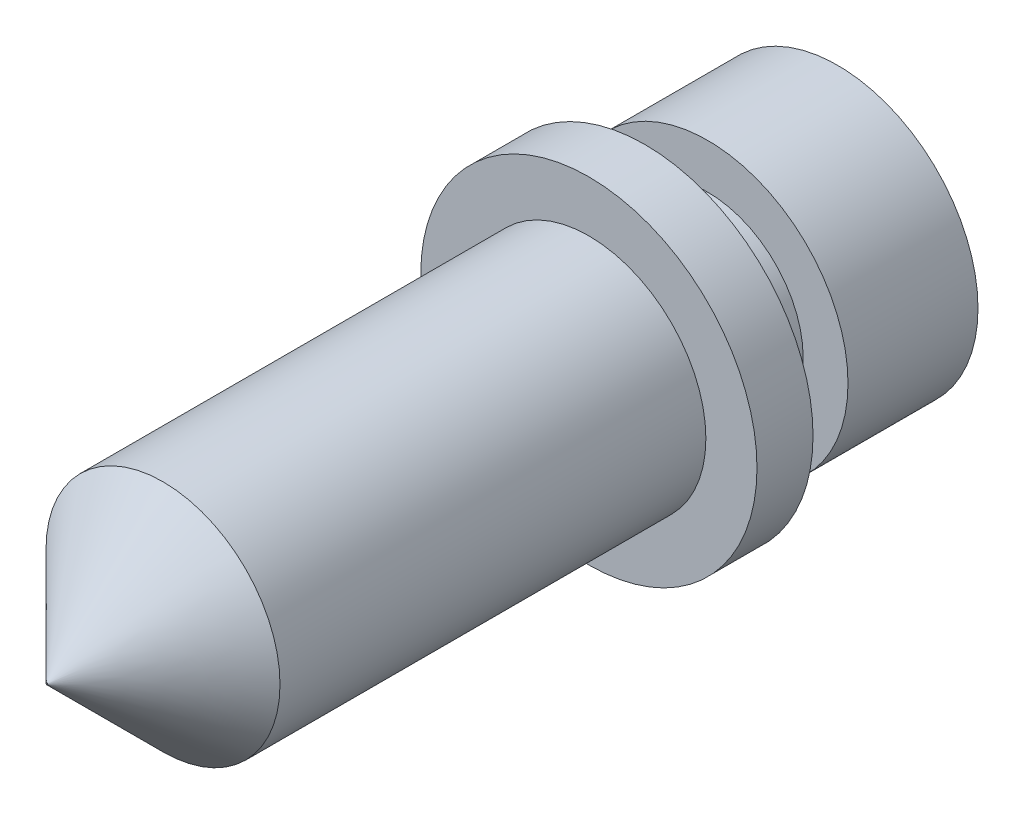
ISO-10303-21;
HEADER;
FILE_DESCRIPTION(('STEP AP214'),'2;1');
FILE_NAME('part.step','',(''),(''),'','','');
FILE_SCHEMA(('AUTOMOTIVE_DESIGN { 1 0 10303 214 1 1 1 1 }'));
ENDSEC;
DATA;
#1=APPLICATION_CONTEXT('core data for automotive mechanical design processes');
#2=APPLICATION_PROTOCOL_DEFINITION('international standard','automotive_design',2000,#1);
#3=PRODUCT_CONTEXT('',#1,'mechanical');
#4=PRODUCT('Part','Part','',(#3));
#5=PRODUCT_RELATED_PRODUCT_CATEGORY('part','',(#4));
#6=PRODUCT_DEFINITION_FORMATION('','',#4);
#7=PRODUCT_DEFINITION_CONTEXT('part definition',#1,'design');
#8=PRODUCT_DEFINITION('design','',#6,#7);
#9=PRODUCT_DEFINITION_SHAPE('','',#8);
#10=(LENGTH_UNIT() NAMED_UNIT(*) SI_UNIT(.MILLI.,.METRE.));
#11=(NAMED_UNIT(*) PLANE_ANGLE_UNIT() SI_UNIT($,.RADIAN.));
#12=(NAMED_UNIT(*) SI_UNIT($,.STERADIAN.) SOLID_ANGLE_UNIT());
#13=UNCERTAINTY_MEASURE_WITH_UNIT(LENGTH_MEASURE(1.E-05),#10,'distance_accuracy_value','');
#14=(GEOMETRIC_REPRESENTATION_CONTEXT(3) GLOBAL_UNCERTAINTY_ASSIGNED_CONTEXT((#13)) GLOBAL_UNIT_ASSIGNED_CONTEXT((#10,
#11,#12)) REPRESENTATION_CONTEXT('',''));
#15=CARTESIAN_POINT('',(0.,0.,0.));
#16=DIRECTION('',(0.,0.,1.));
#17=DIRECTION('',(1.,0.,0.));
#18=AXIS2_PLACEMENT_3D('',#15,#16,#17);
#19=CARTESIAN_POINT('',(0.,0.,12.85875));
#20=DIRECTION('',(0.,0.,-1.));
#21=DIRECTION('',(-1.,0.,0.));
#22=AXIS2_PLACEMENT_3D('',#19,#20,#21);
#23=CONICAL_SURFACE('',#22,3.3147,0.785398163397453);
#24=CARTESIAN_POINT('',(0.,0.,12.85875));
#25=DIRECTION('',(0.,0.,1.));
#26=DIRECTION('',(1.,0.,0.));
#27=AXIS2_PLACEMENT_3D('',#24,#25,#26);
#28=CIRCLE('',#27,3.3147);
#29=CARTESIAN_POINT('',(3.3147,0.,12.85875));
#30=VERTEX_POINT('',#29);
#31=EDGE_CURVE('E59',#30,#30,#28,.T.);
#32=ORIENTED_EDGE('',*,*,#31,.T.);
#33=EDGE_LOOP('',(#32));
#34=FACE_BOUND('',#33,.T.);
#35=CARTESIAN_POINT('',(0.,0.,16.14805));
#36=DIRECTION('',(0.,0.,1.));
#37=DIRECTION('',(1.,0.,0.));
#38=AXIS2_PLACEMENT_3D('',#35,#36,#37);
#39=CIRCLE('',#38,0.0253999999999992);
#40=CARTESIAN_POINT('',(0.0253999999999992,0.,16.14805));
#41=VERTEX_POINT('',#40);
#42=EDGE_CURVE('E49',#41,#41,#39,.F.);
#43=ORIENTED_EDGE('',*,*,#42,.T.);
#44=EDGE_LOOP('',(#43));
#45=FACE_BOUND('',#44,.T.);
#46=ADVANCED_FACE('F31',(#34,#45),#23,.T.);
#47=CARTESIAN_POINT('',(0.,0.,0.79375));
#48=DIRECTION('',(0.,0.,1.));
#49=DIRECTION('',(1.,0.,0.));
#50=AXIS2_PLACEMENT_3D('',#47,#48,#49);
#51=PLANE('',#50);
#52=CARTESIAN_POINT('',(0.,0.,0.79375));
#53=DIRECTION('',(0.,0.,1.));
#54=DIRECTION('',(1.,0.,0.));
#55=AXIS2_PLACEMENT_3D('',#52,#53,#54);
#56=CIRCLE('',#55,4.7625);
#57=CARTESIAN_POINT('',(4.7625,0.,0.79375));
#58=VERTEX_POINT('',#57);
#59=EDGE_CURVE('E42',#58,#58,#56,.T.);
#60=ORIENTED_EDGE('',*,*,#59,.T.);
#61=EDGE_LOOP('',(#60));
#62=FACE_BOUND('',#61,.T.);
#63=CARTESIAN_POINT('',(0.,0.,0.79375));
#64=DIRECTION('',(0.,0.,1.));
#65=DIRECTION('',(1.,0.,0.));
#66=AXIS2_PLACEMENT_3D('',#63,#64,#65);
#67=CIRCLE('',#66,3.3147);
#68=CARTESIAN_POINT('',(3.3147,0.,0.79375));
#69=VERTEX_POINT('',#68);
#70=EDGE_CURVE('E60',#69,#69,#67,.T.);
#71=ORIENTED_EDGE('',*,*,#70,.F.);
#72=EDGE_LOOP('',(#71));
#73=FACE_BOUND('',#72,.T.);
#74=ADVANCED_FACE('F97',(#62,#73),#51,.T.);
#75=CARTESIAN_POINT('',(0.,0.,-0.79375));
#76=DIRECTION('',(0.,0.,1.));
#77=DIRECTION('',(1.,0.,0.));
#78=AXIS2_PLACEMENT_3D('',#75,#76,#77);
#79=PLANE('',#78);
#80=CARTESIAN_POINT('',(0.,0.,-0.79375));
#81=DIRECTION('',(0.,0.,1.));
#82=DIRECTION('',(1.,0.,0.));
#83=AXIS2_PLACEMENT_3D('',#80,#81,#82);
#84=CIRCLE('',#83,4.7625);
#85=CARTESIAN_POINT('',(4.7625,0.,-0.79375));
#86=VERTEX_POINT('',#85);
#87=EDGE_CURVE('E46',#86,#86,#84,.T.);
#88=ORIENTED_EDGE('',*,*,#87,.F.);
#89=EDGE_LOOP('',(#88));
#90=FACE_BOUND('',#89,.T.);
#91=CARTESIAN_POINT('',(0.,0.,-0.79375));
#92=DIRECTION('',(0.,0.,1.));
#93=DIRECTION('',(1.,0.,0.));
#94=AXIS2_PLACEMENT_3D('',#91,#92,#93);
#95=CIRCLE('',#94,2.7051);
#96=CARTESIAN_POINT('',(2.7051,0.,-0.79375));
#97=VERTEX_POINT('',#96);
#98=EDGE_CURVE('E52',#97,#97,#95,.T.);
#99=ORIENTED_EDGE('',*,*,#98,.T.);
#100=EDGE_LOOP('',(#99));
#101=FACE_BOUND('',#100,.T.);
#102=ADVANCED_FACE('F103',(#90,#101),#79,.F.);
#103=CARTESIAN_POINT('',(0.,0.,0.79375));
#104=DIRECTION('',(0.,0.,-1.));
#105=DIRECTION('',(-1.,0.,0.));
#106=AXIS2_PLACEMENT_3D('',#103,#104,#105);
#107=CYLINDRICAL_SURFACE('',#106,4.7625);
#108=ORIENTED_EDGE('',*,*,#59,.F.);
#109=EDGE_LOOP('',(#108));
#110=FACE_BOUND('',#109,.T.);
#111=ORIENTED_EDGE('',*,*,#87,.T.);
#112=EDGE_LOOP('',(#111));
#113=FACE_BOUND('',#112,.T.);
#114=ADVANCED_FACE('F115',(#110,#113),#107,.T.);
#115=CARTESIAN_POINT('',(0.,0.,12.85875));
#116=DIRECTION('',(0.,0.,-1.));
#117=DIRECTION('',(-1.,0.,0.));
#118=AXIS2_PLACEMENT_3D('',#115,#116,#117);
#119=CYLINDRICAL_SURFACE('',#118,3.3147);
#120=ORIENTED_EDGE('',*,*,#31,.F.);
#121=EDGE_LOOP('',(#120));
#122=FACE_BOUND('',#121,.T.);
#123=ORIENTED_EDGE('',*,*,#70,.T.);
#124=EDGE_LOOP('',(#123));
#125=FACE_BOUND('',#124,.T.);
#126=ADVANCED_FACE('F111',(#122,#125),#119,.T.);
#127=CARTESIAN_POINT('',(-3.9751,0.,-2.57175));
#128=DIRECTION('',(0.,0.,1.));
#129=DIRECTION('',(1.,0.,0.));
#130=AXIS2_PLACEMENT_3D('',#127,#128,#129);
#131=PLANE('',#130);
#132=CARTESIAN_POINT('',(0.,0.,-2.57175));
#133=DIRECTION('',(0.,0.,1.));
#134=DIRECTION('',(1.,0.,0.));
#135=AXIS2_PLACEMENT_3D('',#132,#133,#134);
#136=CIRCLE('',#135,3.9751);
#137=CARTESIAN_POINT('',(3.9751,0.,-2.57175));
#138=VERTEX_POINT('',#137);
#139=EDGE_CURVE('E68',#138,#138,#136,.T.);
#140=ORIENTED_EDGE('',*,*,#139,.T.);
#141=EDGE_LOOP('',(#140));
#142=FACE_BOUND('',#141,.T.);
#143=CARTESIAN_POINT('',(0.,0.,-2.57175));
#144=DIRECTION('',(0.,0.,1.));
#145=DIRECTION('',(1.,0.,0.));
#146=AXIS2_PLACEMENT_3D('',#143,#144,#145);
#147=CIRCLE('',#146,2.7051);
#148=CARTESIAN_POINT('',(2.7051,0.,-2.57175));
#149=VERTEX_POINT('',#148);
#150=EDGE_CURVE('E71',#149,#149,#147,.T.);
#151=ORIENTED_EDGE('',*,*,#150,.F.);
#152=EDGE_LOOP('',(#151));
#153=FACE_BOUND('',#152,.T.);
#154=ADVANCED_FACE('F114',(#142,#153),#131,.T.);
#155=CARTESIAN_POINT('',(0.,0.,0.));
#156=DIRECTION('',(0.,0.,1.));
#157=DIRECTION('',(1.,0.,0.));
#158=AXIS2_PLACEMENT_3D('',#155,#156,#157);
#159=CYLINDRICAL_SURFACE('',#158,2.7051);
#160=ORIENTED_EDGE('',*,*,#150,.T.);
#161=EDGE_LOOP('',(#160));
#162=FACE_BOUND('',#161,.T.);
#163=ORIENTED_EDGE('',*,*,#98,.F.);
#164=EDGE_LOOP('',(#163));
#165=FACE_BOUND('',#164,.T.);
#166=ADVANCED_FACE('F135',(#162,#165),#159,.T.);
#167=CARTESIAN_POINT('',(0.,0.,12.79525));
#168=DIRECTION('',(0.,0.,-1.));
#169=DIRECTION('',(-1.,0.,0.));
#170=AXIS2_PLACEMENT_3D('',#167,#168,#169);
#171=PLANE('',#170);
#172=CARTESIAN_POINT('',(0.,0.,12.79525));
#173=DIRECTION('',(0.,0.,-1.));
#174=DIRECTION('',(-1.,0.,0.));
#175=AXIS2_PLACEMENT_3D('',#172,#173,#174);
#176=CIRCLE('',#175,0.0200000000000001);
#177=CARTESIAN_POINT('',(-0.0200000000000001,0.,12.79525));
#178=VERTEX_POINT('',#177);
#179=EDGE_CURVE('E53',#178,#178,#176,.T.);
#180=ORIENTED_EDGE('',*,*,#179,.F.);
#181=EDGE_LOOP('',(#180));
#182=FACE_BOUND('',#181,.T.);
#183=CARTESIAN_POINT('',(0.,0.,12.79525));
#184=DIRECTION('',(0.,0.,-1.));
#185=DIRECTION('',(-1.,0.,0.));
#186=AXIS2_PLACEMENT_3D('',#183,#184,#185);
#187=CIRCLE('',#186,1.5875);
#188=CARTESIAN_POINT('',(-1.5875,0.,12.79525));
#189=VERTEX_POINT('',#188);
#190=EDGE_CURVE('E63',#189,#189,#187,.T.);
#191=ORIENTED_EDGE('',*,*,#190,.T.);
#192=EDGE_LOOP('',(#191));
#193=FACE_BOUND('',#192,.T.);
#194=ADVANCED_FACE('F137',(#182,#193),#171,.T.);
#195=CARTESIAN_POINT('',(0.,0.,12.79525));
#196=DIRECTION('',(0.,0.,-1.));
#197=DIRECTION('',(-1.,0.,0.));
#198=AXIS2_PLACEMENT_3D('',#195,#196,#197);
#199=CYLINDRICAL_SURFACE('',#198,1.5875);
#200=CARTESIAN_POINT('',(0.,0.,-4.98475));
#201=DIRECTION('',(0.,0.,-1.));
#202=DIRECTION('',(-1.,0.,0.));
#203=AXIS2_PLACEMENT_3D('',#200,#201,#202);
#204=CIRCLE('',#203,1.5875);
#205=CARTESIAN_POINT('',(-1.5875,0.,-4.98475));
#206=VERTEX_POINT('',#205);
#207=EDGE_CURVE('E38',#206,#206,#204,.T.);
#208=ORIENTED_EDGE('',*,*,#207,.T.);
#209=EDGE_LOOP('',(#208));
#210=FACE_BOUND('',#209,.T.);
#211=ORIENTED_EDGE('',*,*,#190,.F.);
#212=EDGE_LOOP('',(#211));
#213=FACE_BOUND('',#212,.T.);
#214=ADVANCED_FACE('F109',(#210,#213),#199,.F.);
#215=CARTESIAN_POINT('',(0.,0.,-6.25475));
#216=DIRECTION('',(0.,0.,-1.));
#217=DIRECTION('',(-1.,0.,0.));
#218=AXIS2_PLACEMENT_3D('',#215,#216,#217);
#219=PLANE('',#218);
#220=CARTESIAN_POINT('',(0.,0.,-6.25475));
#221=DIRECTION('',(0.,0.,-1.));
#222=DIRECTION('',(-1.,0.,0.));
#223=AXIS2_PLACEMENT_3D('',#220,#221,#222);
#224=CIRCLE('',#223,2.85750000000001);
#225=CARTESIAN_POINT('',(-2.85750000000001,0.,-6.25475));
#226=VERTEX_POINT('',#225);
#227=EDGE_CURVE('E10',#226,#226,#224,.F.);
#228=ORIENTED_EDGE('',*,*,#227,.T.);
#229=EDGE_LOOP('',(#228));
#230=FACE_BOUND('',#229,.T.);
#231=CARTESIAN_POINT('',(0.,0.,-6.25475));
#232=DIRECTION('',(0.,0.,-1.));
#233=DIRECTION('',(-1.,0.,0.));
#234=AXIS2_PLACEMENT_3D('',#231,#232,#233);
#235=CIRCLE('',#234,3.9751);
#236=CARTESIAN_POINT('',(-3.9751,0.,-6.25475));
#237=VERTEX_POINT('',#236);
#238=EDGE_CURVE('E55',#237,#237,#235,.T.);
#239=ORIENTED_EDGE('',*,*,#238,.T.);
#240=EDGE_LOOP('',(#239));
#241=FACE_BOUND('',#240,.T.);
#242=ADVANCED_FACE('F117',(#230,#241),#219,.T.);
#243=CARTESIAN_POINT('',(0.,0.,-6.25475));
#244=DIRECTION('',(0.,0.,1.));
#245=DIRECTION('',(1.,0.,0.));
#246=AXIS2_PLACEMENT_3D('',#243,#244,#245);
#247=CYLINDRICAL_SURFACE('',#246,3.9751);
#248=ORIENTED_EDGE('',*,*,#238,.F.);
#249=EDGE_LOOP('',(#248));
#250=FACE_BOUND('',#249,.T.);
#251=ORIENTED_EDGE('',*,*,#139,.F.);
#252=EDGE_LOOP('',(#251));
#253=FACE_BOUND('',#252,.T.);
#254=ADVANCED_FACE('F94',(#250,#253),#247,.T.);
#255=CARTESIAN_POINT('',(0.,0.,16.14805));
#256=DIRECTION('',(0.,0.,1.));
#257=DIRECTION('',(1.,0.,0.));
#258=AXIS2_PLACEMENT_3D('',#255,#256,#257);
#259=PLANE('',#258);
#260=CARTESIAN_POINT('',(0.,0.,16.14805));
#261=DIRECTION('',(0.,0.,-1.));
#262=DIRECTION('',(-1.,0.,0.));
#263=AXIS2_PLACEMENT_3D('',#260,#261,#262);
#264=CIRCLE('',#263,0.0200000000000001);
#265=CARTESIAN_POINT('',(-0.0200000000000001,0.,16.14805));
#266=VERTEX_POINT('',#265);
#267=EDGE_CURVE('E78',#266,#266,#264,.T.);
#268=ORIENTED_EDGE('',*,*,#267,.T.);
#269=EDGE_LOOP('',(#268));
#270=FACE_BOUND('',#269,.T.);
#271=ORIENTED_EDGE('',*,*,#42,.F.);
#272=EDGE_LOOP('',(#271));
#273=FACE_BOUND('',#272,.T.);
#274=ADVANCED_FACE('F82',(#270,#273),#259,.T.);
#275=CARTESIAN_POINT('',(0.,0.,16.14805));
#276=DIRECTION('',(0.,0.,-1.));
#277=DIRECTION('',(-1.,0.,0.));
#278=AXIS2_PLACEMENT_3D('',#275,#276,#277);
#279=CYLINDRICAL_SURFACE('',#278,0.0200000000000001);
#280=ORIENTED_EDGE('',*,*,#179,.T.);
#281=EDGE_LOOP('',(#280));
#282=FACE_BOUND('',#281,.T.);
#283=ORIENTED_EDGE('',*,*,#267,.F.);
#284=EDGE_LOOP('',(#283));
#285=FACE_BOUND('',#284,.T.);
#286=ADVANCED_FACE('F85',(#282,#285),#279,.F.);
#287=CARTESIAN_POINT('',(0.,0.,-4.98475));
#288=DIRECTION('',(0.,0.,-1.));
#289=DIRECTION('',(-1.,0.,0.));
#290=AXIS2_PLACEMENT_3D('',#287,#288,#289);
#291=CONICAL_SURFACE('',#290,1.5875,0.785398163397451);
#292=ORIENTED_EDGE('',*,*,#227,.F.);
#293=EDGE_LOOP('',(#292));
#294=FACE_BOUND('',#293,.T.);
#295=ORIENTED_EDGE('',*,*,#207,.F.);
#296=EDGE_LOOP('',(#295));
#297=FACE_BOUND('',#296,.T.);
#298=ADVANCED_FACE('F33',(#294,#297),#291,.F.);
#299=CLOSED_SHELL('',(#46,#74,#102,#114,#126,#154,#166,#194,#214,#242,#254,#274,#286,#298));
#300=MANIFOLD_SOLID_BREP('B2',#299);
#301=ADVANCED_BREP_SHAPE_REPRESENTATION('',(#18,#300),#14);
#302=SHAPE_DEFINITION_REPRESENTATION(#9,#301);
ENDSEC;
END-ISO-10303-21;
